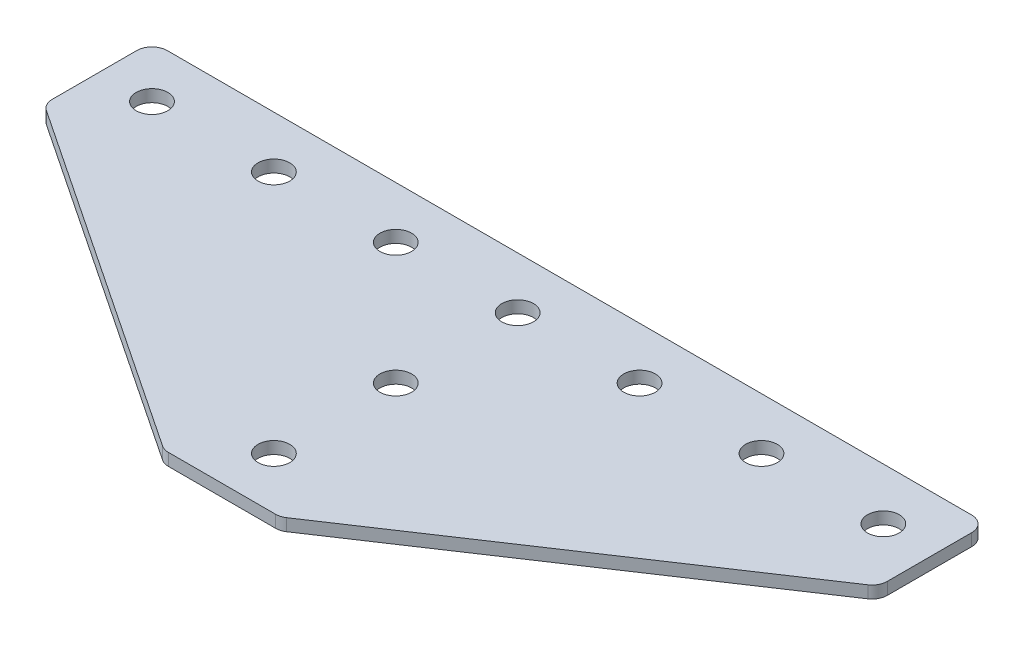
ISO-10303-21;
HEADER;
FILE_DESCRIPTION(('STEP AP214'),'2;1');
FILE_NAME('part.step','',(''),(''),'','','');
FILE_SCHEMA(('AUTOMOTIVE_DESIGN { 1 0 10303 214 1 1 1 1 }'));
ENDSEC;
DATA;
#1=APPLICATION_CONTEXT('core data for automotive mechanical design processes');
#2=APPLICATION_PROTOCOL_DEFINITION('international standard','automotive_design',2000,#1);
#3=PRODUCT_CONTEXT('',#1,'mechanical');
#4=PRODUCT('Part','Part','',(#3));
#5=PRODUCT_RELATED_PRODUCT_CATEGORY('part','',(#4));
#6=PRODUCT_DEFINITION_FORMATION('','',#4);
#7=PRODUCT_DEFINITION_CONTEXT('part definition',#1,'design');
#8=PRODUCT_DEFINITION('design','',#6,#7);
#9=PRODUCT_DEFINITION_SHAPE('','',#8);
#10=(LENGTH_UNIT() NAMED_UNIT(*) SI_UNIT(.MILLI.,.METRE.));
#11=(NAMED_UNIT(*) PLANE_ANGLE_UNIT() SI_UNIT($,.RADIAN.));
#12=(NAMED_UNIT(*) SI_UNIT($,.STERADIAN.) SOLID_ANGLE_UNIT());
#13=UNCERTAINTY_MEASURE_WITH_UNIT(LENGTH_MEASURE(1.E-05),#10,'distance_accuracy_value','');
#14=(GEOMETRIC_REPRESENTATION_CONTEXT(3) GLOBAL_UNCERTAINTY_ASSIGNED_CONTEXT((#13)) GLOBAL_UNIT_ASSIGNED_CONTEXT((#10,
#11,#12)) REPRESENTATION_CONTEXT('',''));
#15=CARTESIAN_POINT('',(0.,0.,0.));
#16=DIRECTION('',(0.,0.,1.));
#17=DIRECTION('',(1.,0.,0.));
#18=AXIS2_PLACEMENT_3D('',#15,#16,#17);
#19=CARTESIAN_POINT('',(-1.64111741986517,1.70798729371791,-21.0664297859648));
#20=DIRECTION('',(0.,-1.,0.));
#21=DIRECTION('',(0.,0.,-1.));
#22=AXIS2_PLACEMENT_3D('',#19,#20,#21);
#23=PLANE('',#22);
#24=CARTESIAN_POINT('',(-1.64111741986517,1.70798729371791,-21.0664297859648));
#25=DIRECTION('',(0.,1.,0.));
#26=DIRECTION('',(0.,0.,1.));
#27=AXIS2_PLACEMENT_3D('',#24,#25,#26);
#28=CIRCLE('',#27,2.6);
#29=CARTESIAN_POINT('',(-1.64111741986517,1.70798729371791,-18.4664297859648));
#30=VERTEX_POINT('',#29);
#31=EDGE_CURVE('E119',#30,#30,#28,.T.);
#32=ORIENTED_EDGE('',*,*,#31,.T.);
#33=EDGE_LOOP('',(#32));
#34=FACE_BOUND('',#33,.T.);
#35=DIRECTION('',(1.,0.,0.));
#36=VECTOR('',#35,1.);
#37=CARTESIAN_POINT('',(-10.1411174198652,1.70798729371791,27.4335702140352));
#38=LINE('',#37,#36);
#39=CARTESIAN_POINT('',(-10.4300148689372,1.70798729371791,27.4335702140352));
#40=VERTEX_POINT('',#39);
#41=CARTESIAN_POINT('',(7.14778002920692,1.70798729371791,27.4335702140352));
#42=VERTEX_POINT('',#41);
#43=EDGE_CURVE('E176',#40,#42,#38,.T.);
#44=ORIENTED_EDGE('',*,*,#43,.F.);
#45=CARTESIAN_POINT('',(-10.4300148689372,1.70798729371791,24.9335702140352));
#46=DIRECTION('',(0.,1.,0.));
#47=DIRECTION('',(0.,0.,-1.));
#48=AXIS2_PLACEMENT_3D('',#45,#46,#47);
#49=CIRCLE('',#48,2.5);
#50=CARTESIAN_POINT('',(-11.8167653595003,1.70798729371791,27.0136959498798));
#51=VERTEX_POINT('',#50);
#52=EDGE_CURVE('E233',#51,#40,#49,.T.);
#53=ORIENTED_EDGE('',*,*,#52,.F.);
#54=DIRECTION('',(-0.832050294337844,0.,-0.554700196225229));
#55=VECTOR('',#54,1.);
#56=CARTESIAN_POINT('',(-11.1869539632672,1.70798729371791,27.4335702140352));
#57=LINE('',#56,#55);
#58=CARTESIAN_POINT('',(-69.0278679104282,1.70798729371791,-11.1270390840721));
#59=VERTEX_POINT('',#58);
#60=EDGE_CURVE('E236',#51,#59,#57,.T.);
#61=ORIENTED_EDGE('',*,*,#60,.T.);
#62=CARTESIAN_POINT('',(-67.6411174198651,1.70798729371791,-13.2071648199167));
#63=DIRECTION('',(0.,1.,0.));
#64=DIRECTION('',(0.,0.,-1.));
#65=AXIS2_PLACEMENT_3D('',#62,#63,#64);
#66=CIRCLE('',#65,2.5);
#67=CARTESIAN_POINT('',(-70.1411174198651,1.70798729371791,-13.2071648199167));
#68=VERTEX_POINT('',#67);
#69=EDGE_CURVE('E239',#68,#59,#66,.T.);
#70=ORIENTED_EDGE('',*,*,#69,.F.);
#71=DIRECTION('',(0.,0.,-1.));
#72=VECTOR('',#71,1.);
#73=CARTESIAN_POINT('',(-70.1411174198651,1.70798729371791,-11.8692054236967));
#74=LINE('',#73,#72);
#75=CARTESIAN_POINT('',(-70.1411174198651,1.70798729371791,-27.0664297859648));
#76=VERTEX_POINT('',#75);
#77=EDGE_CURVE('E130',#68,#76,#74,.T.);
#78=ORIENTED_EDGE('',*,*,#77,.T.);
#79=CARTESIAN_POINT('',(-67.6411174198651,1.70798729371791,-27.0664297859648));
#80=DIRECTION('',(0.,1.,0.));
#81=DIRECTION('',(0.,0.,-1.));
#82=AXIS2_PLACEMENT_3D('',#79,#80,#81);
#83=CIRCLE('',#82,2.5);
#84=CARTESIAN_POINT('',(-67.6411174198651,1.70798729371791,-29.5664297859648));
#85=VERTEX_POINT('',#84);
#86=EDGE_CURVE('E245',#85,#76,#83,.T.);
#87=ORIENTED_EDGE('',*,*,#86,.F.);
#88=DIRECTION('',(-1.,0.,0.));
#89=VECTOR('',#88,1.);
#90=CARTESIAN_POINT('',(66.8588825801348,1.70798729371791,-29.5664297859648));
#91=LINE('',#90,#89);
#92=CARTESIAN_POINT('',(64.3588825801348,1.70798729371791,-29.5664297859648));
#93=VERTEX_POINT('',#92);
#94=EDGE_CURVE('E134',#93,#85,#91,.T.);
#95=ORIENTED_EDGE('',*,*,#94,.F.);
#96=CARTESIAN_POINT('',(64.3588825801348,1.70798729371791,-27.0664297859648));
#97=DIRECTION('',(0.,-1.,0.));
#98=DIRECTION('',(0.,0.,-1.));
#99=AXIS2_PLACEMENT_3D('',#96,#97,#98);
#100=CIRCLE('',#99,2.5);
#101=CARTESIAN_POINT('',(66.8588825801348,1.70798729371791,-27.0664297859648));
#102=VERTEX_POINT('',#101);
#103=EDGE_CURVE('E197',#93,#102,#100,.T.);
#104=ORIENTED_EDGE('',*,*,#103,.T.);
#105=DIRECTION('',(0.,0.,-1.));
#106=VECTOR('',#105,1.);
#107=CARTESIAN_POINT('',(66.8588825801348,1.70798729371791,-11.8692054236967));
#108=LINE('',#107,#106);
#109=CARTESIAN_POINT('',(66.8588825801348,1.70798729371791,-13.2071648199167));
#110=VERTEX_POINT('',#109);
#111=EDGE_CURVE('E181',#110,#102,#108,.T.);
#112=ORIENTED_EDGE('',*,*,#111,.F.);
#113=CARTESIAN_POINT('',(64.3588825801348,1.70798729371791,-13.2071648199167));
#114=DIRECTION('',(0.,-1.,0.));
#115=DIRECTION('',(0.,0.,-1.));
#116=AXIS2_PLACEMENT_3D('',#113,#114,#115);
#117=CIRCLE('',#116,2.5);
#118=CARTESIAN_POINT('',(65.7456330706978,1.70798729371791,-11.1270390840721));
#119=VERTEX_POINT('',#118);
#120=EDGE_CURVE('E31',#110,#119,#117,.T.);
#121=ORIENTED_EDGE('',*,*,#120,.T.);
#122=DIRECTION('',(0.832050294337844,0.,-0.554700196225229));
#123=VECTOR('',#122,1.);
#124=CARTESIAN_POINT('',(7.9047191235369,1.70798729371791,27.4335702140352));
#125=LINE('',#124,#123);
#126=CARTESIAN_POINT('',(8.53453051976999,1.70798729371791,27.0136959498798));
#127=VERTEX_POINT('',#126);
#128=EDGE_CURVE('E179',#127,#119,#125,.T.);
#129=ORIENTED_EDGE('',*,*,#128,.F.);
#130=CARTESIAN_POINT('',(7.14778002920692,1.70798729371791,24.9335702140352));
#131=DIRECTION('',(0.,-1.,0.));
#132=DIRECTION('',(0.,0.,-1.));
#133=AXIS2_PLACEMENT_3D('',#130,#131,#132);
#134=CIRCLE('',#133,2.5);
#135=EDGE_CURVE('E200',#127,#42,#134,.T.);
#136=ORIENTED_EDGE('',*,*,#135,.T.);
#137=EDGE_LOOP('',(#44,#53,#61,#70,#78,#87,#95,#104,#112,#121,#129,#136));
#138=FACE_BOUND('',#137,.T.);
#139=CARTESIAN_POINT('',(-1.64111741986518,1.70798729371791,18.9335702140352));
#140=DIRECTION('',(0.,1.,0.));
#141=DIRECTION('',(0.,0.,1.));
#142=AXIS2_PLACEMENT_3D('',#139,#140,#141);
#143=CIRCLE('',#142,2.6);
#144=CARTESIAN_POINT('',(-1.64111741986518,1.70798729371791,21.5335702140352));
#145=VERTEX_POINT('',#144);
#146=EDGE_CURVE('E153',#145,#145,#143,.T.);
#147=ORIENTED_EDGE('',*,*,#146,.T.);
#148=EDGE_LOOP('',(#147));
#149=FACE_BOUND('',#148,.T.);
#150=CARTESIAN_POINT('',(-1.64111741986518,1.70798729371791,-1.06642978596478));
#151=DIRECTION('',(0.,1.,0.));
#152=DIRECTION('',(0.,0.,1.));
#153=AXIS2_PLACEMENT_3D('',#150,#151,#152);
#154=CIRCLE('',#153,2.6);
#155=CARTESIAN_POINT('',(-1.64111741986518,1.70798729371791,1.53357021403522));
#156=VERTEX_POINT('',#155);
#157=EDGE_CURVE('E159',#156,#156,#154,.T.);
#158=ORIENTED_EDGE('',*,*,#157,.T.);
#159=EDGE_LOOP('',(#158));
#160=FACE_BOUND('',#159,.T.);
#161=CARTESIAN_POINT('',(58.3588825801348,1.70798729371791,-21.0664297859648));
#162=DIRECTION('',(0.,1.,0.));
#163=DIRECTION('',(0.,0.,1.));
#164=AXIS2_PLACEMENT_3D('',#161,#162,#163);
#165=CIRCLE('',#164,2.6);
#166=CARTESIAN_POINT('',(58.3588825801348,1.70798729371791,-18.4664297859648));
#167=VERTEX_POINT('',#166);
#168=EDGE_CURVE('E139',#167,#167,#165,.T.);
#169=ORIENTED_EDGE('',*,*,#168,.T.);
#170=EDGE_LOOP('',(#169));
#171=FACE_BOUND('',#170,.T.);
#172=CARTESIAN_POINT('',(38.3588825801348,1.70798729371791,-21.0664297859648));
#173=DIRECTION('',(0.,1.,0.));
#174=DIRECTION('',(0.,0.,1.));
#175=AXIS2_PLACEMENT_3D('',#172,#173,#174);
#176=CIRCLE('',#175,2.6);
#177=CARTESIAN_POINT('',(38.3588825801348,1.70798729371791,-18.4664297859648));
#178=VERTEX_POINT('',#177);
#179=EDGE_CURVE('E147',#178,#178,#176,.T.);
#180=ORIENTED_EDGE('',*,*,#179,.T.);
#181=EDGE_LOOP('',(#180));
#182=FACE_BOUND('',#181,.T.);
#183=CARTESIAN_POINT('',(18.3588825801348,1.70798729371791,-21.0664297859648));
#184=DIRECTION('',(0.,1.,0.));
#185=DIRECTION('',(0.,0.,1.));
#186=AXIS2_PLACEMENT_3D('',#183,#184,#185);
#187=CIRCLE('',#186,2.6);
#188=CARTESIAN_POINT('',(18.3588825801348,1.70798729371791,-18.4664297859648));
#189=VERTEX_POINT('',#188);
#190=EDGE_CURVE('E165',#189,#189,#187,.T.);
#191=ORIENTED_EDGE('',*,*,#190,.T.);
#192=EDGE_LOOP('',(#191));
#193=FACE_BOUND('',#192,.T.);
#194=CARTESIAN_POINT('',(-61.6411174198652,1.70798729371791,-21.0664297859648));
#195=DIRECTION('',(0.,-1.,0.));
#196=DIRECTION('',(0.,0.,1.));
#197=AXIS2_PLACEMENT_3D('',#194,#195,#196);
#198=CIRCLE('',#197,2.6);
#199=CARTESIAN_POINT('',(-61.6411174198652,1.70798729371791,-18.4664297859648));
#200=VERTEX_POINT('',#199);
#201=EDGE_CURVE('E465',#200,#200,#198,.T.);
#202=ORIENTED_EDGE('',*,*,#201,.F.);
#203=EDGE_LOOP('',(#202));
#204=FACE_BOUND('',#203,.T.);
#205=CARTESIAN_POINT('',(-41.6411174198652,1.70798729371791,-21.0664297859648));
#206=DIRECTION('',(0.,-1.,0.));
#207=DIRECTION('',(0.,0.,1.));
#208=AXIS2_PLACEMENT_3D('',#205,#206,#207);
#209=CIRCLE('',#208,2.6);
#210=CARTESIAN_POINT('',(-41.6411174198652,1.70798729371791,-18.4664297859648));
#211=VERTEX_POINT('',#210);
#212=EDGE_CURVE('E474',#211,#211,#209,.T.);
#213=ORIENTED_EDGE('',*,*,#212,.F.);
#214=EDGE_LOOP('',(#213));
#215=FACE_BOUND('',#214,.T.);
#216=CARTESIAN_POINT('',(-21.6411174198652,1.70798729371791,-21.0664297859648));
#217=DIRECTION('',(0.,-1.,0.));
#218=DIRECTION('',(0.,0.,1.));
#219=AXIS2_PLACEMENT_3D('',#216,#217,#218);
#220=CIRCLE('',#219,2.6);
#221=CARTESIAN_POINT('',(-21.6411174198652,1.70798729371791,-18.4664297859648));
#222=VERTEX_POINT('',#221);
#223=EDGE_CURVE('E266',#222,#222,#220,.T.);
#224=ORIENTED_EDGE('',*,*,#223,.F.);
#225=EDGE_LOOP('',(#224));
#226=FACE_BOUND('',#225,.T.);
#227=ADVANCED_FACE('F16',(#34,#138,#149,#160,#171,#182,#193,#204,#215,#226),#23,.T.);
#228=CARTESIAN_POINT('',(66.8588825801348,1.70798729371791,-29.5664297859648));
#229=DIRECTION('',(0.,0.,-1.));
#230=DIRECTION('',(-1.,0.,0.));
#231=AXIS2_PLACEMENT_3D('',#228,#229,#230);
#232=PLANE('',#231);
#233=ORIENTED_EDGE('',*,*,#94,.T.);
#234=DIRECTION('',(0.,1.,0.));
#235=VECTOR('',#234,1.);
#236=CARTESIAN_POINT('',(-67.6411174198651,1.70798729371791,-29.5664297859648));
#237=LINE('',#236,#235);
#238=CARTESIAN_POINT('',(-67.6411174198651,3.70798729371791,-29.5664297859648));
#239=VERTEX_POINT('',#238);
#240=EDGE_CURVE('E125',#239,#85,#237,.F.);
#241=ORIENTED_EDGE('',*,*,#240,.F.);
#242=DIRECTION('',(-1.,0.,0.));
#243=VECTOR('',#242,1.);
#244=CARTESIAN_POINT('',(66.8588825801348,3.70798729371791,-29.5664297859648));
#245=LINE('',#244,#243);
#246=CARTESIAN_POINT('',(64.3588825801348,3.70798729371791,-29.5664297859648));
#247=VERTEX_POINT('',#246);
#248=EDGE_CURVE('E105',#247,#239,#245,.T.);
#249=ORIENTED_EDGE('',*,*,#248,.F.);
#250=DIRECTION('',(0.,1.,0.));
#251=VECTOR('',#250,1.);
#252=CARTESIAN_POINT('',(64.3588825801348,1.70798729371791,-29.5664297859648));
#253=LINE('',#252,#251);
#254=EDGE_CURVE('E10',#247,#93,#253,.F.);
#255=ORIENTED_EDGE('',*,*,#254,.T.);
#256=EDGE_LOOP('',(#233,#241,#249,#255));
#257=FACE_BOUND('',#256,.T.);
#258=ADVANCED_FACE('F132',(#257),#232,.T.);
#259=CARTESIAN_POINT('',(66.8588825801348,1.70798729371791,-11.8692054236967));
#260=DIRECTION('',(1.,0.,0.));
#261=DIRECTION('',(0.,0.,-1.));
#262=AXIS2_PLACEMENT_3D('',#259,#260,#261);
#263=PLANE('',#262);
#264=DIRECTION('',(0.,0.,-1.));
#265=VECTOR('',#264,1.);
#266=CARTESIAN_POINT('',(66.8588825801348,3.70798729371791,-11.8692054236967));
#267=LINE('',#266,#265);
#268=CARTESIAN_POINT('',(66.8588825801348,3.70798729371791,-13.2071648199167));
#269=VERTEX_POINT('',#268);
#270=CARTESIAN_POINT('',(66.8588825801348,3.70798729371791,-27.0664297859648));
#271=VERTEX_POINT('',#270);
#272=EDGE_CURVE('E177',#269,#271,#267,.T.);
#273=ORIENTED_EDGE('',*,*,#272,.F.);
#274=DIRECTION('',(0.,1.,0.));
#275=VECTOR('',#274,1.);
#276=CARTESIAN_POINT('',(66.8588825801348,1.70798729371791,-13.2071648199167));
#277=LINE('',#276,#275);
#278=EDGE_CURVE('E24',#269,#110,#277,.F.);
#279=ORIENTED_EDGE('',*,*,#278,.T.);
#280=ORIENTED_EDGE('',*,*,#111,.T.);
#281=DIRECTION('',(0.,1.,0.));
#282=VECTOR('',#281,1.);
#283=CARTESIAN_POINT('',(66.8588825801348,1.70798729371791,-27.0664297859648));
#284=LINE('',#283,#282);
#285=EDGE_CURVE('E207',#102,#271,#284,.T.);
#286=ORIENTED_EDGE('',*,*,#285,.T.);
#287=EDGE_LOOP('',(#273,#279,#280,#286));
#288=FACE_BOUND('',#287,.T.);
#289=ADVANCED_FACE('F212',(#288),#263,.T.);
#290=CARTESIAN_POINT('',(7.9047191235369,1.70798729371791,27.4335702140352));
#291=DIRECTION('',(0.554700196225229,0.,0.832050294337844));
#292=DIRECTION('',(0.832050294337844,0.,-0.554700196225229));
#293=AXIS2_PLACEMENT_3D('',#290,#291,#292);
#294=PLANE('',#293);
#295=DIRECTION('',(0.832050294337844,0.,-0.554700196225229));
#296=VECTOR('',#295,1.);
#297=CARTESIAN_POINT('',(7.9047191235369,3.70798729371791,27.4335702140352));
#298=LINE('',#297,#296);
#299=CARTESIAN_POINT('',(8.53453051976999,3.70798729371791,27.0136959498798));
#300=VERTEX_POINT('',#299);
#301=CARTESIAN_POINT('',(65.7456330706978,3.70798729371791,-11.1270390840721));
#302=VERTEX_POINT('',#301);
#303=EDGE_CURVE('E185',#300,#302,#298,.T.);
#304=ORIENTED_EDGE('',*,*,#303,.F.);
#305=DIRECTION('',(0.,1.,0.));
#306=VECTOR('',#305,1.);
#307=CARTESIAN_POINT('',(8.53453051976999,1.70798729371791,27.0136959498798));
#308=LINE('',#307,#306);
#309=EDGE_CURVE('E38',#300,#127,#308,.F.);
#310=ORIENTED_EDGE('',*,*,#309,.T.);
#311=ORIENTED_EDGE('',*,*,#128,.T.);
#312=DIRECTION('',(0.,1.,0.));
#313=VECTOR('',#312,1.);
#314=CARTESIAN_POINT('',(65.7456330706978,1.70798729371791,-11.1270390840721));
#315=LINE('',#314,#313);
#316=EDGE_CURVE('E203',#119,#302,#315,.T.);
#317=ORIENTED_EDGE('',*,*,#316,.T.);
#318=EDGE_LOOP('',(#304,#310,#311,#317));
#319=FACE_BOUND('',#318,.T.);
#320=ADVANCED_FACE('F219',(#319),#294,.T.);
#321=CARTESIAN_POINT('',(-10.1411174198652,1.70798729371791,27.4335702140352));
#322=DIRECTION('',(0.,0.,1.));
#323=DIRECTION('',(1.,0.,0.));
#324=AXIS2_PLACEMENT_3D('',#321,#322,#323);
#325=PLANE('',#324);
#326=DIRECTION('',(1.,0.,0.));
#327=VECTOR('',#326,1.);
#328=CARTESIAN_POINT('',(-10.1411174198652,3.70798729371791,27.4335702140352));
#329=LINE('',#328,#327);
#330=CARTESIAN_POINT('',(-10.4300148689372,3.70798729371791,27.4335702140352));
#331=VERTEX_POINT('',#330);
#332=CARTESIAN_POINT('',(7.14778002920692,3.70798729371791,27.4335702140352));
#333=VERTEX_POINT('',#332);
#334=EDGE_CURVE('E118',#331,#333,#329,.T.);
#335=ORIENTED_EDGE('',*,*,#334,.F.);
#336=DIRECTION('',(0.,1.,0.));
#337=VECTOR('',#336,1.);
#338=CARTESIAN_POINT('',(-10.4300148689372,1.70798729371791,27.4335702140352));
#339=LINE('',#338,#337);
#340=EDGE_CURVE('E229',#40,#331,#339,.T.);
#341=ORIENTED_EDGE('',*,*,#340,.F.);
#342=ORIENTED_EDGE('',*,*,#43,.T.);
#343=DIRECTION('',(0.,1.,0.));
#344=VECTOR('',#343,1.);
#345=CARTESIAN_POINT('',(7.14778002920692,1.70798729371791,27.4335702140352));
#346=LINE('',#345,#344);
#347=EDGE_CURVE('E194',#42,#333,#346,.T.);
#348=ORIENTED_EDGE('',*,*,#347,.T.);
#349=EDGE_LOOP('',(#335,#341,#342,#348));
#350=FACE_BOUND('',#349,.T.);
#351=ADVANCED_FACE('F226',(#350),#325,.T.);
#352=CARTESIAN_POINT('',(-1.64111741986517,3.70798729371791,-21.0664297859648));
#353=DIRECTION('',(0.,-1.,0.));
#354=DIRECTION('',(0.,0.,-1.));
#355=AXIS2_PLACEMENT_3D('',#352,#353,#354);
#356=PLANE('',#355);
#357=CARTESIAN_POINT('',(-1.64111741986517,3.70798729371791,-21.0664297859648));
#358=DIRECTION('',(0.,1.,0.));
#359=DIRECTION('',(0.,0.,1.));
#360=AXIS2_PLACEMENT_3D('',#357,#358,#359);
#361=CIRCLE('',#360,2.6);
#362=CARTESIAN_POINT('',(-1.64111741986517,3.70798729371791,-18.4664297859648));
#363=VERTEX_POINT('',#362);
#364=EDGE_CURVE('E168',#363,#363,#361,.T.);
#365=ORIENTED_EDGE('',*,*,#364,.F.);
#366=EDGE_LOOP('',(#365));
#367=FACE_BOUND('',#366,.T.);
#368=CARTESIAN_POINT('',(-10.4300148689372,3.70798729371791,24.9335702140352));
#369=DIRECTION('',(0.,1.,0.));
#370=DIRECTION('',(0.,0.,-1.));
#371=AXIS2_PLACEMENT_3D('',#368,#369,#370);
#372=CIRCLE('',#371,2.5);
#373=CARTESIAN_POINT('',(-11.8167653595003,3.70798729371791,27.0136959498798));
#374=VERTEX_POINT('',#373);
#375=EDGE_CURVE('E251',#331,#374,#372,.F.);
#376=ORIENTED_EDGE('',*,*,#375,.F.);
#377=ORIENTED_EDGE('',*,*,#334,.T.);
#378=CARTESIAN_POINT('',(7.14778002920692,3.70798729371791,24.9335702140352));
#379=DIRECTION('',(0.,-1.,0.));
#380=DIRECTION('',(0.,0.,-1.));
#381=AXIS2_PLACEMENT_3D('',#378,#379,#380);
#382=CIRCLE('',#381,2.5);
#383=EDGE_CURVE('E192',#333,#300,#382,.F.);
#384=ORIENTED_EDGE('',*,*,#383,.T.);
#385=ORIENTED_EDGE('',*,*,#303,.T.);
#386=CARTESIAN_POINT('',(64.3588825801348,3.70798729371791,-13.2071648199167));
#387=DIRECTION('',(0.,-1.,0.));
#388=DIRECTION('',(0.,0.,-1.));
#389=AXIS2_PLACEMENT_3D('',#386,#387,#388);
#390=CIRCLE('',#389,2.5);
#391=EDGE_CURVE('E190',#302,#269,#390,.F.);
#392=ORIENTED_EDGE('',*,*,#391,.T.);
#393=ORIENTED_EDGE('',*,*,#272,.T.);
#394=CARTESIAN_POINT('',(64.3588825801348,3.70798729371791,-27.0664297859648));
#395=DIRECTION('',(0.,-1.,0.));
#396=DIRECTION('',(0.,0.,-1.));
#397=AXIS2_PLACEMENT_3D('',#394,#395,#396);
#398=CIRCLE('',#397,2.5);
#399=EDGE_CURVE('E114',#271,#247,#398,.F.);
#400=ORIENTED_EDGE('',*,*,#399,.T.);
#401=ORIENTED_EDGE('',*,*,#248,.T.);
#402=CARTESIAN_POINT('',(-67.6411174198651,3.70798729371791,-27.0664297859648));
#403=DIRECTION('',(0.,1.,0.));
#404=DIRECTION('',(0.,0.,-1.));
#405=AXIS2_PLACEMENT_3D('',#402,#403,#404);
#406=CIRCLE('',#405,2.5);
#407=CARTESIAN_POINT('',(-70.1411174198651,3.70798729371791,-27.0664297859648));
#408=VERTEX_POINT('',#407);
#409=EDGE_CURVE('E111',#408,#239,#406,.F.);
#410=ORIENTED_EDGE('',*,*,#409,.F.);
#411=DIRECTION('',(0.,0.,-1.));
#412=VECTOR('',#411,1.);
#413=CARTESIAN_POINT('',(-70.1411174198651,3.70798729371791,-11.8692054236967));
#414=LINE('',#413,#412);
#415=CARTESIAN_POINT('',(-70.1411174198651,3.70798729371791,-13.2071648199167));
#416=VERTEX_POINT('',#415);
#417=EDGE_CURVE('E256',#416,#408,#414,.T.);
#418=ORIENTED_EDGE('',*,*,#417,.F.);
#419=CARTESIAN_POINT('',(-67.6411174198651,3.70798729371791,-13.2071648199167));
#420=DIRECTION('',(0.,1.,0.));
#421=DIRECTION('',(0.,0.,-1.));
#422=AXIS2_PLACEMENT_3D('',#419,#420,#421);
#423=CIRCLE('',#422,2.5);
#424=CARTESIAN_POINT('',(-69.0278679104282,3.70798729371791,-11.1270390840721));
#425=VERTEX_POINT('',#424);
#426=EDGE_CURVE('E129',#425,#416,#423,.F.);
#427=ORIENTED_EDGE('',*,*,#426,.F.);
#428=DIRECTION('',(-0.832050294337844,0.,-0.554700196225229));
#429=VECTOR('',#428,1.);
#430=CARTESIAN_POINT('',(-11.1869539632672,3.70798729371791,27.4335702140352));
#431=LINE('',#430,#429);
#432=EDGE_CURVE('E260',#374,#425,#431,.T.);
#433=ORIENTED_EDGE('',*,*,#432,.F.);
#434=EDGE_LOOP('',(#376,#377,#384,#385,#392,#393,#400,#401,#410,#418,#427,#433));
#435=FACE_BOUND('',#434,.T.);
#436=CARTESIAN_POINT('',(-1.64111741986518,3.70798729371791,18.9335702140352));
#437=DIRECTION('',(0.,1.,0.));
#438=DIRECTION('',(0.,0.,1.));
#439=AXIS2_PLACEMENT_3D('',#436,#437,#438);
#440=CIRCLE('',#439,2.6);
#441=CARTESIAN_POINT('',(-1.64111741986518,3.70798729371791,21.5335702140352));
#442=VERTEX_POINT('',#441);
#443=EDGE_CURVE('E150',#442,#442,#440,.T.);
#444=ORIENTED_EDGE('',*,*,#443,.F.);
#445=EDGE_LOOP('',(#444));
#446=FACE_BOUND('',#445,.T.);
#447=CARTESIAN_POINT('',(58.3588825801348,3.70798729371791,-21.0664297859648));
#448=DIRECTION('',(0.,1.,0.));
#449=DIRECTION('',(0.,0.,1.));
#450=AXIS2_PLACEMENT_3D('',#447,#448,#449);
#451=CIRCLE('',#450,2.6);
#452=CARTESIAN_POINT('',(58.3588825801348,3.70798729371791,-18.4664297859648));
#453=VERTEX_POINT('',#452);
#454=EDGE_CURVE('E135',#453,#453,#451,.T.);
#455=ORIENTED_EDGE('',*,*,#454,.F.);
#456=EDGE_LOOP('',(#455));
#457=FACE_BOUND('',#456,.T.);
#458=CARTESIAN_POINT('',(38.3588825801348,3.70798729371791,-21.0664297859648));
#459=DIRECTION('',(0.,1.,0.));
#460=DIRECTION('',(0.,0.,1.));
#461=AXIS2_PLACEMENT_3D('',#458,#459,#460);
#462=CIRCLE('',#461,2.6);
#463=CARTESIAN_POINT('',(38.3588825801348,3.70798729371791,-18.4664297859648));
#464=VERTEX_POINT('',#463);
#465=EDGE_CURVE('E145',#464,#464,#462,.T.);
#466=ORIENTED_EDGE('',*,*,#465,.F.);
#467=EDGE_LOOP('',(#466));
#468=FACE_BOUND('',#467,.T.);
#469=CARTESIAN_POINT('',(18.3588825801348,3.70798729371791,-21.0664297859648));
#470=DIRECTION('',(0.,1.,0.));
#471=DIRECTION('',(0.,0.,1.));
#472=AXIS2_PLACEMENT_3D('',#469,#470,#471);
#473=CIRCLE('',#472,2.6);
#474=CARTESIAN_POINT('',(18.3588825801348,3.70798729371791,-18.4664297859648));
#475=VERTEX_POINT('',#474);
#476=EDGE_CURVE('E162',#475,#475,#473,.T.);
#477=ORIENTED_EDGE('',*,*,#476,.F.);
#478=EDGE_LOOP('',(#477));
#479=FACE_BOUND('',#478,.T.);
#480=CARTESIAN_POINT('',(-1.64111741986518,3.70798729371791,-1.06642978596478));
#481=DIRECTION('',(0.,1.,0.));
#482=DIRECTION('',(0.,0.,1.));
#483=AXIS2_PLACEMENT_3D('',#480,#481,#482);
#484=CIRCLE('',#483,2.6);
#485=CARTESIAN_POINT('',(-1.64111741986518,3.70798729371791,1.53357021403522));
#486=VERTEX_POINT('',#485);
#487=EDGE_CURVE('E156',#486,#486,#484,.T.);
#488=ORIENTED_EDGE('',*,*,#487,.F.);
#489=EDGE_LOOP('',(#488));
#490=FACE_BOUND('',#489,.T.);
#491=CARTESIAN_POINT('',(-61.6411174198652,3.70798729371791,-21.0664297859648));
#492=DIRECTION('',(0.,-1.,0.));
#493=DIRECTION('',(0.,0.,1.));
#494=AXIS2_PLACEMENT_3D('',#491,#492,#493);
#495=CIRCLE('',#494,2.6);
#496=CARTESIAN_POINT('',(-61.6411174198652,3.70798729371791,-18.4664297859648));
#497=VERTEX_POINT('',#496);
#498=EDGE_CURVE('E468',#497,#497,#495,.T.);
#499=ORIENTED_EDGE('',*,*,#498,.T.);
#500=EDGE_LOOP('',(#499));
#501=FACE_BOUND('',#500,.T.);
#502=CARTESIAN_POINT('',(-41.6411174198652,3.70798729371791,-21.0664297859648));
#503=DIRECTION('',(0.,-1.,0.));
#504=DIRECTION('',(0.,0.,1.));
#505=AXIS2_PLACEMENT_3D('',#502,#503,#504);
#506=CIRCLE('',#505,2.6);
#507=CARTESIAN_POINT('',(-41.6411174198652,3.70798729371791,-18.4664297859648));
#508=VERTEX_POINT('',#507);
#509=EDGE_CURVE('E471',#508,#508,#506,.T.);
#510=ORIENTED_EDGE('',*,*,#509,.T.);
#511=EDGE_LOOP('',(#510));
#512=FACE_BOUND('',#511,.T.);
#513=CARTESIAN_POINT('',(-21.6411174198652,3.70798729371791,-21.0664297859648));
#514=DIRECTION('',(0.,-1.,0.));
#515=DIRECTION('',(0.,0.,1.));
#516=AXIS2_PLACEMENT_3D('',#513,#514,#515);
#517=CIRCLE('',#516,2.6);
#518=CARTESIAN_POINT('',(-21.6411174198652,3.70798729371791,-18.4664297859648));
#519=VERTEX_POINT('',#518);
#520=EDGE_CURVE('E263',#519,#519,#517,.T.);
#521=ORIENTED_EDGE('',*,*,#520,.T.);
#522=EDGE_LOOP('',(#521));
#523=FACE_BOUND('',#522,.T.);
#524=ADVANCED_FACE('F108',(#367,#435,#446,#457,#468,#479,#490,#501,#512,#523),#356,.F.);
#525=CARTESIAN_POINT('',(7.14778002920692,1.70798729371791,24.9335702140352));
#526=DIRECTION('',(0.,1.,0.));
#527=DIRECTION('',(0.,0.,1.));
#528=AXIS2_PLACEMENT_3D('',#525,#526,#527);
#529=CYLINDRICAL_SURFACE('',#528,2.5);
#530=ORIENTED_EDGE('',*,*,#135,.F.);
#531=ORIENTED_EDGE('',*,*,#309,.F.);
#532=ORIENTED_EDGE('',*,*,#383,.F.);
#533=ORIENTED_EDGE('',*,*,#347,.F.);
#534=EDGE_LOOP('',(#530,#531,#532,#533));
#535=FACE_BOUND('',#534,.T.);
#536=ADVANCED_FACE('F224',(#535),#529,.T.);
#537=CARTESIAN_POINT('',(64.3588825801348,1.70798729371791,-13.2071648199167));
#538=DIRECTION('',(0.,1.,0.));
#539=DIRECTION('',(0.,0.,1.));
#540=AXIS2_PLACEMENT_3D('',#537,#538,#539);
#541=CYLINDRICAL_SURFACE('',#540,2.5);
#542=ORIENTED_EDGE('',*,*,#120,.F.);
#543=ORIENTED_EDGE('',*,*,#278,.F.);
#544=ORIENTED_EDGE('',*,*,#391,.F.);
#545=ORIENTED_EDGE('',*,*,#316,.F.);
#546=EDGE_LOOP('',(#542,#543,#544,#545));
#547=FACE_BOUND('',#546,.T.);
#548=ADVANCED_FACE('F218',(#547),#541,.T.);
#549=CARTESIAN_POINT('',(64.3588825801348,1.70798729371791,-27.0664297859648));
#550=DIRECTION('',(0.,1.,0.));
#551=DIRECTION('',(0.,0.,1.));
#552=AXIS2_PLACEMENT_3D('',#549,#550,#551);
#553=CYLINDRICAL_SURFACE('',#552,2.5);
#554=ORIENTED_EDGE('',*,*,#103,.F.);
#555=ORIENTED_EDGE('',*,*,#254,.F.);
#556=ORIENTED_EDGE('',*,*,#399,.F.);
#557=ORIENTED_EDGE('',*,*,#285,.F.);
#558=EDGE_LOOP('',(#554,#555,#556,#557));
#559=FACE_BOUND('',#558,.T.);
#560=ADVANCED_FACE('F18',(#559),#553,.T.);
#561=CARTESIAN_POINT('',(-1.64111741986517,1.70798729371791,-21.0664297859648));
#562=DIRECTION('',(0.,1.,0.));
#563=DIRECTION('',(0.,0.,1.));
#564=AXIS2_PLACEMENT_3D('',#561,#562,#563);
#565=CYLINDRICAL_SURFACE('',#564,2.6);
#566=ORIENTED_EDGE('',*,*,#31,.F.);
#567=EDGE_LOOP('',(#566));
#568=FACE_BOUND('',#567,.T.);
#569=ORIENTED_EDGE('',*,*,#364,.T.);
#570=EDGE_LOOP('',(#569));
#571=FACE_BOUND('',#570,.T.);
#572=ADVANCED_FACE('F300',(#568,#571),#565,.F.);
#573=CARTESIAN_POINT('',(18.3588825801348,1.70798729371791,-21.0664297859648));
#574=DIRECTION('',(0.,1.,0.));
#575=DIRECTION('',(0.,0.,1.));
#576=AXIS2_PLACEMENT_3D('',#573,#574,#575);
#577=CYLINDRICAL_SURFACE('',#576,2.6);
#578=ORIENTED_EDGE('',*,*,#190,.F.);
#579=EDGE_LOOP('',(#578));
#580=FACE_BOUND('',#579,.T.);
#581=ORIENTED_EDGE('',*,*,#476,.T.);
#582=EDGE_LOOP('',(#581));
#583=FACE_BOUND('',#582,.T.);
#584=ADVANCED_FACE('F305',(#580,#583),#577,.F.);
#585=CARTESIAN_POINT('',(-1.64111741986518,1.70798729371791,-1.06642978596478));
#586=DIRECTION('',(0.,1.,0.));
#587=DIRECTION('',(0.,0.,1.));
#588=AXIS2_PLACEMENT_3D('',#585,#586,#587);
#589=CYLINDRICAL_SURFACE('',#588,2.6);
#590=ORIENTED_EDGE('',*,*,#487,.T.);
#591=EDGE_LOOP('',(#590));
#592=FACE_BOUND('',#591,.T.);
#593=ORIENTED_EDGE('',*,*,#157,.F.);
#594=EDGE_LOOP('',(#593));
#595=FACE_BOUND('',#594,.T.);
#596=ADVANCED_FACE('F311',(#592,#595),#589,.F.);
#597=CARTESIAN_POINT('',(-1.64111741986518,1.70798729371791,18.9335702140352));
#598=DIRECTION('',(0.,1.,0.));
#599=DIRECTION('',(0.,0.,1.));
#600=AXIS2_PLACEMENT_3D('',#597,#598,#599);
#601=CYLINDRICAL_SURFACE('',#600,2.6);
#602=ORIENTED_EDGE('',*,*,#443,.T.);
#603=EDGE_LOOP('',(#602));
#604=FACE_BOUND('',#603,.T.);
#605=ORIENTED_EDGE('',*,*,#146,.F.);
#606=EDGE_LOOP('',(#605));
#607=FACE_BOUND('',#606,.T.);
#608=ADVANCED_FACE('F366',(#604,#607),#601,.F.);
#609=CARTESIAN_POINT('',(38.3588825801348,1.70798729371791,-21.0664297859648));
#610=DIRECTION('',(0.,1.,0.));
#611=DIRECTION('',(0.,0.,1.));
#612=AXIS2_PLACEMENT_3D('',#609,#610,#611);
#613=CYLINDRICAL_SURFACE('',#612,2.6);
#614=ORIENTED_EDGE('',*,*,#179,.F.);
#615=EDGE_LOOP('',(#614));
#616=FACE_BOUND('',#615,.T.);
#617=ORIENTED_EDGE('',*,*,#465,.T.);
#618=EDGE_LOOP('',(#617));
#619=FACE_BOUND('',#618,.T.);
#620=ADVANCED_FACE('F375',(#616,#619),#613,.F.);
#621=CARTESIAN_POINT('',(58.3588825801348,1.70798729371791,-21.0664297859648));
#622=DIRECTION('',(0.,1.,0.));
#623=DIRECTION('',(0.,0.,1.));
#624=AXIS2_PLACEMENT_3D('',#621,#622,#623);
#625=CYLINDRICAL_SURFACE('',#624,2.6);
#626=ORIENTED_EDGE('',*,*,#168,.F.);
#627=EDGE_LOOP('',(#626));
#628=FACE_BOUND('',#627,.T.);
#629=ORIENTED_EDGE('',*,*,#454,.T.);
#630=EDGE_LOOP('',(#629));
#631=FACE_BOUND('',#630,.T.);
#632=ADVANCED_FACE('F385',(#628,#631),#625,.F.);
#633=CARTESIAN_POINT('',(-70.1411174198651,1.70798729371791,-11.8692054236967));
#634=DIRECTION('',(-1.,0.,0.));
#635=DIRECTION('',(0.,0.,-1.));
#636=AXIS2_PLACEMENT_3D('',#633,#634,#635);
#637=PLANE('',#636);
#638=ORIENTED_EDGE('',*,*,#417,.T.);
#639=DIRECTION('',(0.,1.,0.));
#640=VECTOR('',#639,1.);
#641=CARTESIAN_POINT('',(-70.1411174198651,1.70798729371791,-27.0664297859648));
#642=LINE('',#641,#640);
#643=EDGE_CURVE('E127',#76,#408,#642,.T.);
#644=ORIENTED_EDGE('',*,*,#643,.F.);
#645=ORIENTED_EDGE('',*,*,#77,.F.);
#646=DIRECTION('',(0.,1.,0.));
#647=VECTOR('',#646,1.);
#648=CARTESIAN_POINT('',(-70.1411174198651,1.70798729371791,-13.2071648199167));
#649=LINE('',#648,#647);
#650=EDGE_CURVE('E136',#416,#68,#649,.F.);
#651=ORIENTED_EDGE('',*,*,#650,.F.);
#652=EDGE_LOOP('',(#638,#644,#645,#651));
#653=FACE_BOUND('',#652,.T.);
#654=ADVANCED_FACE('F273',(#653),#637,.T.);
#655=CARTESIAN_POINT('',(-11.1869539632672,1.70798729371791,27.4335702140352));
#656=DIRECTION('',(-0.554700196225229,0.,0.832050294337844));
#657=DIRECTION('',(-0.832050294337844,0.,-0.554700196225229));
#658=AXIS2_PLACEMENT_3D('',#655,#656,#657);
#659=PLANE('',#658);
#660=ORIENTED_EDGE('',*,*,#432,.T.);
#661=DIRECTION('',(0.,1.,0.));
#662=VECTOR('',#661,1.);
#663=CARTESIAN_POINT('',(-69.0278679104282,1.70798729371791,-11.1270390840721));
#664=LINE('',#663,#662);
#665=EDGE_CURVE('E238',#59,#425,#664,.T.);
#666=ORIENTED_EDGE('',*,*,#665,.F.);
#667=ORIENTED_EDGE('',*,*,#60,.F.);
#668=DIRECTION('',(0.,1.,0.));
#669=VECTOR('',#668,1.);
#670=CARTESIAN_POINT('',(-11.8167653595003,1.70798729371791,27.0136959498798));
#671=LINE('',#670,#669);
#672=EDGE_CURVE('E242',#374,#51,#671,.F.);
#673=ORIENTED_EDGE('',*,*,#672,.F.);
#674=EDGE_LOOP('',(#660,#666,#667,#673));
#675=FACE_BOUND('',#674,.T.);
#676=ADVANCED_FACE('F255',(#675),#659,.T.);
#677=CARTESIAN_POINT('',(-10.4300148689372,1.70798729371791,24.9335702140352));
#678=DIRECTION('',(0.,1.,0.));
#679=DIRECTION('',(0.,0.,1.));
#680=AXIS2_PLACEMENT_3D('',#677,#678,#679);
#681=CYLINDRICAL_SURFACE('',#680,2.5);
#682=ORIENTED_EDGE('',*,*,#52,.T.);
#683=ORIENTED_EDGE('',*,*,#340,.T.);
#684=ORIENTED_EDGE('',*,*,#375,.T.);
#685=ORIENTED_EDGE('',*,*,#672,.T.);
#686=EDGE_LOOP('',(#682,#683,#684,#685));
#687=FACE_BOUND('',#686,.T.);
#688=ADVANCED_FACE('F250',(#687),#681,.T.);
#689=CARTESIAN_POINT('',(-67.6411174198651,1.70798729371791,-13.2071648199167));
#690=DIRECTION('',(0.,1.,0.));
#691=DIRECTION('',(0.,0.,1.));
#692=AXIS2_PLACEMENT_3D('',#689,#690,#691);
#693=CYLINDRICAL_SURFACE('',#692,2.5);
#694=ORIENTED_EDGE('',*,*,#69,.T.);
#695=ORIENTED_EDGE('',*,*,#665,.T.);
#696=ORIENTED_EDGE('',*,*,#426,.T.);
#697=ORIENTED_EDGE('',*,*,#650,.T.);
#698=EDGE_LOOP('',(#694,#695,#696,#697));
#699=FACE_BOUND('',#698,.T.);
#700=ADVANCED_FACE('F275',(#699),#693,.T.);
#701=CARTESIAN_POINT('',(-67.6411174198651,1.70798729371791,-27.0664297859648));
#702=DIRECTION('',(0.,1.,0.));
#703=DIRECTION('',(0.,0.,1.));
#704=AXIS2_PLACEMENT_3D('',#701,#702,#703);
#705=CYLINDRICAL_SURFACE('',#704,2.5);
#706=ORIENTED_EDGE('',*,*,#86,.T.);
#707=ORIENTED_EDGE('',*,*,#643,.T.);
#708=ORIENTED_EDGE('',*,*,#409,.T.);
#709=ORIENTED_EDGE('',*,*,#240,.T.);
#710=EDGE_LOOP('',(#706,#707,#708,#709));
#711=FACE_BOUND('',#710,.T.);
#712=ADVANCED_FACE('F124',(#711),#705,.T.);
#713=CARTESIAN_POINT('',(-21.6411174198652,1.70798729371791,-21.0664297859648));
#714=DIRECTION('',(0.,1.,0.));
#715=DIRECTION('',(0.,0.,1.));
#716=AXIS2_PLACEMENT_3D('',#713,#714,#715);
#717=CYLINDRICAL_SURFACE('',#716,2.6);
#718=ORIENTED_EDGE('',*,*,#223,.T.);
#719=EDGE_LOOP('',(#718));
#720=FACE_BOUND('',#719,.T.);
#721=ORIENTED_EDGE('',*,*,#520,.F.);
#722=EDGE_LOOP('',(#721));
#723=FACE_BOUND('',#722,.T.);
#724=ADVANCED_FACE('F283',(#720,#723),#717,.F.);
#725=CARTESIAN_POINT('',(-41.6411174198652,1.70798729371791,-21.0664297859648));
#726=DIRECTION('',(0.,1.,0.));
#727=DIRECTION('',(0.,0.,1.));
#728=AXIS2_PLACEMENT_3D('',#725,#726,#727);
#729=CYLINDRICAL_SURFACE('',#728,2.6);
#730=ORIENTED_EDGE('',*,*,#212,.T.);
#731=EDGE_LOOP('',(#730));
#732=FACE_BOUND('',#731,.T.);
#733=ORIENTED_EDGE('',*,*,#509,.F.);
#734=EDGE_LOOP('',(#733));
#735=FACE_BOUND('',#734,.T.);
#736=ADVANCED_FACE('F436',(#732,#735),#729,.F.);
#737=CARTESIAN_POINT('',(-61.6411174198652,1.70798729371791,-21.0664297859648));
#738=DIRECTION('',(0.,1.,0.));
#739=DIRECTION('',(0.,0.,1.));
#740=AXIS2_PLACEMENT_3D('',#737,#738,#739);
#741=CYLINDRICAL_SURFACE('',#740,2.6);
#742=ORIENTED_EDGE('',*,*,#201,.T.);
#743=EDGE_LOOP('',(#742));
#744=FACE_BOUND('',#743,.T.);
#745=ORIENTED_EDGE('',*,*,#498,.F.);
#746=EDGE_LOOP('',(#745));
#747=FACE_BOUND('',#746,.T.);
#748=ADVANCED_FACE('F446',(#744,#747),#741,.F.);
#749=CLOSED_SHELL('',(#227,#258,#289,#320,#351,#524,#536,#548,#560,#572,#584,#596,#608,#620,
#632,#654,#676,#688,#700,#712,#724,#736,#748));
#750=MANIFOLD_SOLID_BREP('B1',#749);
#751=ADVANCED_BREP_SHAPE_REPRESENTATION('',(#18,#750),#14);
#752=SHAPE_DEFINITION_REPRESENTATION(#9,#751);
ENDSEC;
END-ISO-10303-21;
